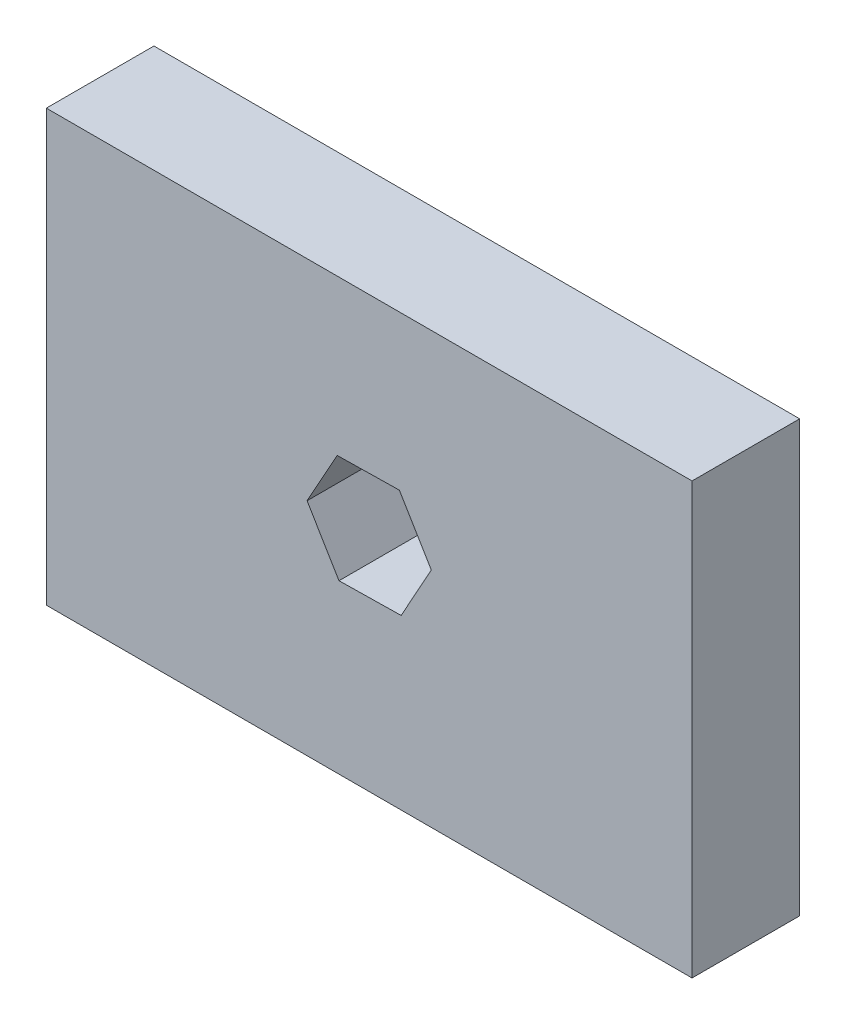
ISO-10303-21;
HEADER;
FILE_DESCRIPTION(('STEP AP214'),'2;1');
FILE_NAME('part.step','',(''),(''),'','','');
FILE_SCHEMA(('AUTOMOTIVE_DESIGN { 1 0 10303 214 1 1 1 1 }'));
ENDSEC;
DATA;
#1=APPLICATION_CONTEXT('core data for automotive mechanical design processes');
#2=APPLICATION_PROTOCOL_DEFINITION('international standard','automotive_design',2000,#1);
#3=PRODUCT_CONTEXT('',#1,'mechanical');
#4=PRODUCT('Part','Part','',(#3));
#5=PRODUCT_RELATED_PRODUCT_CATEGORY('part','',(#4));
#6=PRODUCT_DEFINITION_FORMATION('','',#4);
#7=PRODUCT_DEFINITION_CONTEXT('part definition',#1,'design');
#8=PRODUCT_DEFINITION('design','',#6,#7);
#9=PRODUCT_DEFINITION_SHAPE('','',#8);
#10=(LENGTH_UNIT() NAMED_UNIT(*) SI_UNIT(.MILLI.,.METRE.));
#11=(NAMED_UNIT(*) PLANE_ANGLE_UNIT() SI_UNIT($,.RADIAN.));
#12=(NAMED_UNIT(*) SI_UNIT($,.STERADIAN.) SOLID_ANGLE_UNIT());
#13=UNCERTAINTY_MEASURE_WITH_UNIT(LENGTH_MEASURE(1.E-05),#10,'distance_accuracy_value','');
#14=(GEOMETRIC_REPRESENTATION_CONTEXT(3) GLOBAL_UNCERTAINTY_ASSIGNED_CONTEXT((#13)) GLOBAL_UNIT_ASSIGNED_CONTEXT((#10,
#11,#12)) REPRESENTATION_CONTEXT('',''));
#15=CARTESIAN_POINT('',(0.,0.,0.));
#16=DIRECTION('',(0.,0.,1.));
#17=DIRECTION('',(1.,0.,0.));
#18=AXIS2_PLACEMENT_3D('',#15,#16,#17);
#19=CARTESIAN_POINT('',(38.1,-25.4,6.35));
#20=DIRECTION('',(-1.,0.,0.));
#21=DIRECTION('',(0.,0.,1.));
#22=AXIS2_PLACEMENT_3D('',#19,#20,#21);
#23=PLANE('',#22);
#24=DIRECTION('',(0.,1.,0.));
#25=VECTOR('',#24,1.);
#26=CARTESIAN_POINT('',(38.1,-25.4,-6.35));
#27=LINE('',#26,#25);
#28=CARTESIAN_POINT('',(38.1,-25.4,-6.35));
#29=VERTEX_POINT('',#28);
#30=CARTESIAN_POINT('',(38.1,25.4,-6.35));
#31=VERTEX_POINT('',#30);
#32=EDGE_CURVE('E156',#29,#31,#27,.T.);
#33=ORIENTED_EDGE('',*,*,#32,.T.);
#34=DIRECTION('',(0.,0.,-1.));
#35=VECTOR('',#34,1.);
#36=CARTESIAN_POINT('',(38.1,25.4,6.35));
#37=LINE('',#36,#35);
#38=CARTESIAN_POINT('',(38.1,25.4,6.35));
#39=VERTEX_POINT('',#38);
#40=EDGE_CURVE('E11',#39,#31,#37,.T.);
#41=ORIENTED_EDGE('',*,*,#40,.F.);
#42=DIRECTION('',(0.,1.,0.));
#43=VECTOR('',#42,1.);
#44=CARTESIAN_POINT('',(38.1,-25.4,6.35));
#45=LINE('',#44,#43);
#46=CARTESIAN_POINT('',(38.1,-25.4,6.35));
#47=VERTEX_POINT('',#46);
#48=EDGE_CURVE('E164',#47,#39,#45,.T.);
#49=ORIENTED_EDGE('',*,*,#48,.F.);
#50=DIRECTION('',(0.,0.,-1.));
#51=VECTOR('',#50,1.);
#52=CARTESIAN_POINT('',(38.1,-25.4,6.35));
#53=LINE('',#52,#51);
#54=EDGE_CURVE('E174',#47,#29,#53,.T.);
#55=ORIENTED_EDGE('',*,*,#54,.T.);
#56=EDGE_LOOP('',(#33,#41,#49,#55));
#57=FACE_BOUND('',#56,.T.);
#58=ADVANCED_FACE('F35',(#57),#23,.F.);
#59=CARTESIAN_POINT('',(-38.1,25.4,6.35));
#60=DIRECTION('',(0.,-1.,0.));
#61=DIRECTION('',(0.,0.,-1.));
#62=AXIS2_PLACEMENT_3D('',#59,#60,#61);
#63=PLANE('',#62);
#64=DIRECTION('',(-1.,0.,0.));
#65=VECTOR('',#64,1.);
#66=CARTESIAN_POINT('',(-38.1,25.4,-6.35));
#67=LINE('',#66,#65);
#68=CARTESIAN_POINT('',(-38.1,25.4,-6.35));
#69=VERTEX_POINT('',#68);
#70=EDGE_CURVE('E177',#31,#69,#67,.T.);
#71=ORIENTED_EDGE('',*,*,#70,.T.);
#72=DIRECTION('',(0.,0.,-1.));
#73=VECTOR('',#72,1.);
#74=CARTESIAN_POINT('',(-38.1,25.4,6.35));
#75=LINE('',#74,#73);
#76=CARTESIAN_POINT('',(-38.1,25.4,6.35));
#77=VERTEX_POINT('',#76);
#78=EDGE_CURVE('E42',#77,#69,#75,.T.);
#79=ORIENTED_EDGE('',*,*,#78,.F.);
#80=DIRECTION('',(-1.,0.,0.));
#81=VECTOR('',#80,1.);
#82=CARTESIAN_POINT('',(-38.1,25.4,6.35));
#83=LINE('',#82,#81);
#84=EDGE_CURVE('E167',#39,#77,#83,.T.);
#85=ORIENTED_EDGE('',*,*,#84,.F.);
#86=ORIENTED_EDGE('',*,*,#40,.T.);
#87=EDGE_LOOP('',(#71,#79,#85,#86));
#88=FACE_BOUND('',#87,.T.);
#89=ADVANCED_FACE('F205',(#88),#63,.F.);
#90=CARTESIAN_POINT('',(-38.1,-25.4,6.35));
#91=DIRECTION('',(1.,0.,0.));
#92=DIRECTION('',(0.,0.,-1.));
#93=AXIS2_PLACEMENT_3D('',#90,#91,#92);
#94=PLANE('',#93);
#95=DIRECTION('',(0.,-1.,0.));
#96=VECTOR('',#95,1.);
#97=CARTESIAN_POINT('',(-38.1,-25.4,-6.35));
#98=LINE('',#97,#96);
#99=CARTESIAN_POINT('',(-38.1,-25.4,-6.35));
#100=VERTEX_POINT('',#99);
#101=EDGE_CURVE('E179',#69,#100,#98,.T.);
#102=ORIENTED_EDGE('',*,*,#101,.T.);
#103=DIRECTION('',(0.,0.,-1.));
#104=VECTOR('',#103,1.);
#105=CARTESIAN_POINT('',(-38.1,-25.4,6.35));
#106=LINE('',#105,#104);
#107=CARTESIAN_POINT('',(-38.1,-25.4,6.35));
#108=VERTEX_POINT('',#107);
#109=EDGE_CURVE('E184',#108,#100,#106,.T.);
#110=ORIENTED_EDGE('',*,*,#109,.F.);
#111=DIRECTION('',(0.,-1.,0.));
#112=VECTOR('',#111,1.);
#113=CARTESIAN_POINT('',(-38.1,-25.4,6.35));
#114=LINE('',#113,#112);
#115=EDGE_CURVE('E170',#77,#108,#114,.T.);
#116=ORIENTED_EDGE('',*,*,#115,.F.);
#117=ORIENTED_EDGE('',*,*,#78,.T.);
#118=EDGE_LOOP('',(#102,#110,#116,#117));
#119=FACE_BOUND('',#118,.T.);
#120=ADVANCED_FACE('F191',(#119),#94,.F.);
#121=CARTESIAN_POINT('',(-38.1,-25.4,6.35));
#122=DIRECTION('',(0.,1.,0.));
#123=DIRECTION('',(0.,0.,1.));
#124=AXIS2_PLACEMENT_3D('',#121,#122,#123);
#125=PLANE('',#124);
#126=DIRECTION('',(1.,0.,0.));
#127=VECTOR('',#126,1.);
#128=CARTESIAN_POINT('',(-38.1,-25.4,-6.35));
#129=LINE('',#128,#127);
#130=EDGE_CURVE('E168',#100,#29,#129,.T.);
#131=ORIENTED_EDGE('',*,*,#130,.T.);
#132=ORIENTED_EDGE('',*,*,#54,.F.);
#133=DIRECTION('',(1.,0.,0.));
#134=VECTOR('',#133,1.);
#135=CARTESIAN_POINT('',(-38.1,-25.4,6.35));
#136=LINE('',#135,#134);
#137=EDGE_CURVE('E172',#108,#47,#136,.T.);
#138=ORIENTED_EDGE('',*,*,#137,.F.);
#139=ORIENTED_EDGE('',*,*,#109,.T.);
#140=EDGE_LOOP('',(#131,#132,#138,#139));
#141=FACE_BOUND('',#140,.T.);
#142=ADVANCED_FACE('F198',(#141),#125,.F.);
#143=CARTESIAN_POINT('',(0.,0.,6.35));
#144=DIRECTION('',(0.,0.,-1.));
#145=DIRECTION('',(-1.,0.,0.));
#146=AXIS2_PLACEMENT_3D('',#143,#144,#145);
#147=PLANE('',#146);
#148=DIRECTION('',(0.99986685087298,0.0163181042204618,0.));
#149=VECTOR('',#148,1.);
#150=CARTESIAN_POINT('',(-3.56206609965878,-5.63041703156285,6.35));
#151=LINE('',#150,#149);
#152=CARTESIAN_POINT('',(-3.56206609965878,-5.63041703156285,6.35));
#153=VERTEX_POINT('',#152);
#154=CARTESIAN_POINT('',(3.76930602325851,-5.51076700588563,6.35));
#155=VERTEX_POINT('',#154);
#156=EDGE_CURVE('E144',#153,#155,#151,.T.);
#157=ORIENTED_EDGE('',*,*,#156,.F.);
#158=DIRECTION('',(0.514065318233012,-0.857751041147717,0.));
#159=VECTOR('',#158,1.);
#160=CARTESIAN_POINT('',(-7.33137212291736,0.658912458641966,6.35));
#161=LINE('',#160,#159);
#162=CARTESIAN_POINT('',(-7.33137212291736,0.658912458641966,6.35));
#163=VERTEX_POINT('',#162);
#164=EDGE_CURVE('E49',#163,#153,#161,.T.);
#165=ORIENTED_EDGE('',*,*,#164,.F.);
#166=DIRECTION('',(-0.485801532639968,-0.874069145368178,0.));
#167=VECTOR('',#166,1.);
#168=CARTESIAN_POINT('',(-3.76930602325865,7.067891974524,6.35));
#169=LINE('',#168,#167);
#170=CARTESIAN_POINT('',(-3.76930602325865,7.067891974524,6.35));
#171=VERTEX_POINT('',#170);
#172=EDGE_CURVE('E130',#171,#163,#169,.T.);
#173=ORIENTED_EDGE('',*,*,#172,.F.);
#174=DIRECTION('',(-0.99986685087298,-0.0163181042204621,0.));
#175=VECTOR('',#174,1.);
#176=CARTESIAN_POINT('',(3.56206609965864,7.18754200020122,6.35));
#177=LINE('',#176,#175);
#178=CARTESIAN_POINT('',(3.56206609965864,7.18754200020122,6.35));
#179=VERTEX_POINT('',#178);
#180=EDGE_CURVE('E133',#179,#171,#177,.T.);
#181=ORIENTED_EDGE('',*,*,#180,.F.);
#182=DIRECTION('',(-0.514065318233012,0.857751041147717,0.));
#183=VECTOR('',#182,1.);
#184=CARTESIAN_POINT('',(7.33137212291722,0.898212509996404,6.35));
#185=LINE('',#184,#183);
#186=CARTESIAN_POINT('',(7.33137212291722,0.898212509996404,6.35));
#187=VERTEX_POINT('',#186);
#188=EDGE_CURVE('E149',#187,#179,#185,.T.);
#189=ORIENTED_EDGE('',*,*,#188,.F.);
#190=DIRECTION('',(0.485801532639968,0.874069145368179,0.));
#191=VECTOR('',#190,1.);
#192=CARTESIAN_POINT('',(3.76930602325851,-5.51076700588563,6.35));
#193=LINE('',#192,#191);
#194=EDGE_CURVE('E146',#155,#187,#193,.T.);
#195=ORIENTED_EDGE('',*,*,#194,.F.);
#196=EDGE_LOOP('',(#157,#165,#173,#181,#189,#195));
#197=FACE_BOUND('',#196,.T.);
#198=ORIENTED_EDGE('',*,*,#48,.T.);
#199=ORIENTED_EDGE('',*,*,#84,.T.);
#200=ORIENTED_EDGE('',*,*,#115,.T.);
#201=ORIENTED_EDGE('',*,*,#137,.T.);
#202=EDGE_LOOP('',(#198,#199,#200,#201));
#203=FACE_BOUND('',#202,.T.);
#204=ADVANCED_FACE('F204',(#197,#203),#147,.F.);
#205=CARTESIAN_POINT('',(0.,0.,-6.35));
#206=DIRECTION('',(0.,0.,-1.));
#207=DIRECTION('',(-1.,0.,0.));
#208=AXIS2_PLACEMENT_3D('',#205,#206,#207);
#209=PLANE('',#208);
#210=DIRECTION('',(0.514065318233012,-0.857751041147717,0.));
#211=VECTOR('',#210,1.);
#212=CARTESIAN_POINT('',(-7.33137212291736,0.658912458641966,-6.35));
#213=LINE('',#212,#211);
#214=CARTESIAN_POINT('',(-7.33137212291736,0.658912458641966,-6.35));
#215=VERTEX_POINT('',#214);
#216=CARTESIAN_POINT('',(-3.56206609965878,-5.63041703156285,-6.35));
#217=VERTEX_POINT('',#216);
#218=EDGE_CURVE('E113',#215,#217,#213,.T.);
#219=ORIENTED_EDGE('',*,*,#218,.T.);
#220=DIRECTION('',(0.99986685087298,0.0163181042204618,0.));
#221=VECTOR('',#220,1.);
#222=CARTESIAN_POINT('',(-3.56206609965878,-5.63041703156285,-6.35));
#223=LINE('',#222,#221);
#224=CARTESIAN_POINT('',(3.76930602325851,-5.51076700588563,-6.35));
#225=VERTEX_POINT('',#224);
#226=EDGE_CURVE('E122',#217,#225,#223,.T.);
#227=ORIENTED_EDGE('',*,*,#226,.T.);
#228=DIRECTION('',(0.485801532639968,0.874069145368179,0.));
#229=VECTOR('',#228,1.);
#230=CARTESIAN_POINT('',(3.76930602325851,-5.51076700588563,-6.35));
#231=LINE('',#230,#229);
#232=CARTESIAN_POINT('',(7.33137212291722,0.898212509996404,-6.35));
#233=VERTEX_POINT('',#232);
#234=EDGE_CURVE('E57',#225,#233,#231,.T.);
#235=ORIENTED_EDGE('',*,*,#234,.T.);
#236=DIRECTION('',(-0.514065318233012,0.857751041147717,0.));
#237=VECTOR('',#236,1.);
#238=CARTESIAN_POINT('',(7.33137212291722,0.898212509996404,-6.35));
#239=LINE('',#238,#237);
#240=CARTESIAN_POINT('',(3.56206609965864,7.18754200020122,-6.35));
#241=VERTEX_POINT('',#240);
#242=EDGE_CURVE('E137',#233,#241,#239,.T.);
#243=ORIENTED_EDGE('',*,*,#242,.T.);
#244=DIRECTION('',(-0.99986685087298,-0.0163181042204621,0.));
#245=VECTOR('',#244,1.);
#246=CARTESIAN_POINT('',(3.56206609965864,7.18754200020122,-6.35));
#247=LINE('',#246,#245);
#248=CARTESIAN_POINT('',(-3.76930602325865,7.067891974524,-6.35));
#249=VERTEX_POINT('',#248);
#250=EDGE_CURVE('E140',#241,#249,#247,.T.);
#251=ORIENTED_EDGE('',*,*,#250,.T.);
#252=DIRECTION('',(-0.485801532639968,-0.874069145368178,0.));
#253=VECTOR('',#252,1.);
#254=CARTESIAN_POINT('',(-3.76930602325865,7.067891974524,-6.35));
#255=LINE('',#254,#253);
#256=EDGE_CURVE('E119',#249,#215,#255,.T.);
#257=ORIENTED_EDGE('',*,*,#256,.T.);
#258=EDGE_LOOP('',(#219,#227,#235,#243,#251,#257));
#259=FACE_BOUND('',#258,.T.);
#260=ORIENTED_EDGE('',*,*,#32,.F.);
#261=ORIENTED_EDGE('',*,*,#130,.F.);
#262=ORIENTED_EDGE('',*,*,#101,.F.);
#263=ORIENTED_EDGE('',*,*,#70,.F.);
#264=EDGE_LOOP('',(#260,#261,#262,#263));
#265=FACE_BOUND('',#264,.T.);
#266=ADVANCED_FACE('F126',(#259,#265),#209,.T.);
#267=CARTESIAN_POINT('',(-7.33137212291736,0.658912458641966,-6.35));
#268=DIRECTION('',(-0.857751041147717,-0.514065318233012,0.));
#269=DIRECTION('',(0.514065318233012,-0.857751041147717,0.));
#270=AXIS2_PLACEMENT_3D('',#267,#268,#269);
#271=PLANE('',#270);
#272=ORIENTED_EDGE('',*,*,#164,.T.);
#273=DIRECTION('',(0.,0.,1.));
#274=VECTOR('',#273,1.);
#275=CARTESIAN_POINT('',(-3.56206609965878,-5.63041703156285,-6.35));
#276=LINE('',#275,#274);
#277=EDGE_CURVE('E109',#217,#153,#276,.T.);
#278=ORIENTED_EDGE('',*,*,#277,.F.);
#279=ORIENTED_EDGE('',*,*,#218,.F.);
#280=DIRECTION('',(0.,0.,1.));
#281=VECTOR('',#280,1.);
#282=CARTESIAN_POINT('',(-7.33137212291736,0.658912458641966,-6.35));
#283=LINE('',#282,#281);
#284=EDGE_CURVE('E154',#215,#163,#283,.T.);
#285=ORIENTED_EDGE('',*,*,#284,.T.);
#286=EDGE_LOOP('',(#272,#278,#279,#285));
#287=FACE_BOUND('',#286,.T.);
#288=ADVANCED_FACE('F111',(#287),#271,.F.);
#289=CARTESIAN_POINT('',(-3.76930602325865,7.067891974524,-6.35));
#290=DIRECTION('',(-0.874069145368178,0.485801532639968,0.));
#291=DIRECTION('',(-0.485801532639968,-0.874069145368178,0.));
#292=AXIS2_PLACEMENT_3D('',#289,#290,#291);
#293=PLANE('',#292);
#294=ORIENTED_EDGE('',*,*,#172,.T.);
#295=ORIENTED_EDGE('',*,*,#284,.F.);
#296=ORIENTED_EDGE('',*,*,#256,.F.);
#297=DIRECTION('',(0.,0.,1.));
#298=VECTOR('',#297,1.);
#299=CARTESIAN_POINT('',(-3.76930602325865,7.067891974524,-6.35));
#300=LINE('',#299,#298);
#301=EDGE_CURVE('E157',#249,#171,#300,.T.);
#302=ORIENTED_EDGE('',*,*,#301,.T.);
#303=EDGE_LOOP('',(#294,#295,#296,#302));
#304=FACE_BOUND('',#303,.T.);
#305=ADVANCED_FACE('F222',(#304),#293,.F.);
#306=CARTESIAN_POINT('',(3.56206609965864,7.18754200020122,-6.35));
#307=DIRECTION('',(-0.0163181042204621,0.99986685087298,0.));
#308=DIRECTION('',(-0.99986685087298,-0.0163181042204621,0.));
#309=AXIS2_PLACEMENT_3D('',#306,#307,#308);
#310=PLANE('',#309);
#311=ORIENTED_EDGE('',*,*,#180,.T.);
#312=ORIENTED_EDGE('',*,*,#301,.F.);
#313=ORIENTED_EDGE('',*,*,#250,.F.);
#314=DIRECTION('',(0.,0.,1.));
#315=VECTOR('',#314,1.);
#316=CARTESIAN_POINT('',(3.56206609965864,7.18754200020122,-6.35));
#317=LINE('',#316,#315);
#318=EDGE_CURVE('E159',#241,#179,#317,.T.);
#319=ORIENTED_EDGE('',*,*,#318,.T.);
#320=EDGE_LOOP('',(#311,#312,#313,#319));
#321=FACE_BOUND('',#320,.T.);
#322=ADVANCED_FACE('F231',(#321),#310,.F.);
#323=CARTESIAN_POINT('',(7.33137212291722,0.898212509996404,-6.35));
#324=DIRECTION('',(0.857751041147717,0.514065318233012,0.));
#325=DIRECTION('',(-0.514065318233012,0.857751041147717,0.));
#326=AXIS2_PLACEMENT_3D('',#323,#324,#325);
#327=PLANE('',#326);
#328=ORIENTED_EDGE('',*,*,#188,.T.);
#329=ORIENTED_EDGE('',*,*,#318,.F.);
#330=ORIENTED_EDGE('',*,*,#242,.F.);
#331=DIRECTION('',(0.,0.,1.));
#332=VECTOR('',#331,1.);
#333=CARTESIAN_POINT('',(7.33137212291722,0.898212509996404,-6.35));
#334=LINE('',#333,#332);
#335=EDGE_CURVE('E161',#233,#187,#334,.T.);
#336=ORIENTED_EDGE('',*,*,#335,.T.);
#337=EDGE_LOOP('',(#328,#329,#330,#336));
#338=FACE_BOUND('',#337,.T.);
#339=ADVANCED_FACE('F228',(#338),#327,.F.);
#340=CARTESIAN_POINT('',(3.76930602325851,-5.51076700588563,-6.35));
#341=DIRECTION('',(0.874069145368178,-0.485801532639968,0.));
#342=DIRECTION('',(0.485801532639968,0.874069145368179,0.));
#343=AXIS2_PLACEMENT_3D('',#340,#341,#342);
#344=PLANE('',#343);
#345=ORIENTED_EDGE('',*,*,#194,.T.);
#346=ORIENTED_EDGE('',*,*,#335,.F.);
#347=ORIENTED_EDGE('',*,*,#234,.F.);
#348=DIRECTION('',(0.,0.,1.));
#349=VECTOR('',#348,1.);
#350=CARTESIAN_POINT('',(3.76930602325851,-5.51076700588563,-6.35));
#351=LINE('',#350,#349);
#352=EDGE_CURVE('E118',#225,#155,#351,.T.);
#353=ORIENTED_EDGE('',*,*,#352,.T.);
#354=EDGE_LOOP('',(#345,#346,#347,#353));
#355=FACE_BOUND('',#354,.T.);
#356=ADVANCED_FACE('F225',(#355),#344,.F.);
#357=CARTESIAN_POINT('',(-3.56206609965878,-5.63041703156285,-6.35));
#358=DIRECTION('',(0.0163181042204618,-0.99986685087298,0.));
#359=DIRECTION('',(0.99986685087298,0.0163181042204618,0.));
#360=AXIS2_PLACEMENT_3D('',#357,#358,#359);
#361=PLANE('',#360);
#362=ORIENTED_EDGE('',*,*,#156,.T.);
#363=ORIENTED_EDGE('',*,*,#352,.F.);
#364=ORIENTED_EDGE('',*,*,#226,.F.);
#365=ORIENTED_EDGE('',*,*,#277,.T.);
#366=EDGE_LOOP('',(#362,#363,#364,#365));
#367=FACE_BOUND('',#366,.T.);
#368=ADVANCED_FACE('F123',(#367),#361,.F.);
#369=CLOSED_SHELL('',(#58,#89,#120,#142,#204,#266,#288,#305,#322,#339,#356,#368));
#370=MANIFOLD_SOLID_BREP('B2',#369);
#371=ADVANCED_BREP_SHAPE_REPRESENTATION('',(#18,#370),#14);
#372=SHAPE_DEFINITION_REPRESENTATION(#9,#371);
ENDSEC;
END-ISO-10303-21;
